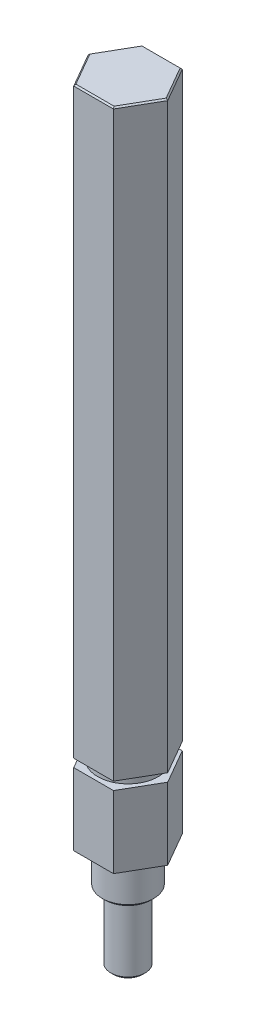
ISO-10303-21;
HEADER;
FILE_DESCRIPTION(('STEP AP214'),'2;1');
FILE_NAME('part.step','',(''),(''),'','','');
FILE_SCHEMA(('AUTOMOTIVE_DESIGN { 1 0 10303 214 1 1 1 1 }'));
ENDSEC;
DATA;
#1=APPLICATION_CONTEXT('core data for automotive mechanical design processes');
#2=APPLICATION_PROTOCOL_DEFINITION('international standard','automotive_design',2000,#1);
#3=PRODUCT_CONTEXT('',#1,'mechanical');
#4=PRODUCT('Part','Part','',(#3));
#5=PRODUCT_RELATED_PRODUCT_CATEGORY('part','',(#4));
#6=PRODUCT_DEFINITION_FORMATION('','',#4);
#7=PRODUCT_DEFINITION_CONTEXT('part definition',#1,'design');
#8=PRODUCT_DEFINITION('design','',#6,#7);
#9=PRODUCT_DEFINITION_SHAPE('','',#8);
#10=(LENGTH_UNIT() NAMED_UNIT(*) SI_UNIT(.MILLI.,.METRE.));
#11=(NAMED_UNIT(*) PLANE_ANGLE_UNIT() SI_UNIT($,.RADIAN.));
#12=(NAMED_UNIT(*) SI_UNIT($,.STERADIAN.) SOLID_ANGLE_UNIT());
#13=UNCERTAINTY_MEASURE_WITH_UNIT(LENGTH_MEASURE(1.E-05),#10,'distance_accuracy_value','');
#14=(GEOMETRIC_REPRESENTATION_CONTEXT(3) GLOBAL_UNCERTAINTY_ASSIGNED_CONTEXT((#13)) GLOBAL_UNIT_ASSIGNED_CONTEXT((#10,
#11,#12)) REPRESENTATION_CONTEXT('',''));
#15=CARTESIAN_POINT('',(0.,0.,0.));
#16=DIRECTION('',(0.,0.,1.));
#17=DIRECTION('',(1.,0.,0.));
#18=AXIS2_PLACEMENT_3D('',#15,#16,#17);
#19=CARTESIAN_POINT('',(-38.3071337161431,-45.212,-16.669011646302));
#20=DIRECTION('',(0.,1.,0.));
#21=DIRECTION('',(0.,0.,1.));
#22=AXIS2_PLACEMENT_3D('',#19,#20,#21);
#23=PLANE('',#22);
#24=CARTESIAN_POINT('',(-38.3071337161431,-45.2119999999923,-16.669011646302));
#25=DIRECTION('',(0.,1.,0.));
#26=DIRECTION('',(0.,0.,1.));
#27=AXIS2_PLACEMENT_3D('',#24,#25,#26);
#28=CIRCLE('',#27,2.65430000009029);
#29=CARTESIAN_POINT('',(-38.3071337161431,-45.2119999999923,-14.0147116462117));
#30=VERTEX_POINT('',#29);
#31=EDGE_CURVE('E19',#30,#30,#28,.T.);
#32=ORIENTED_EDGE('',*,*,#31,.F.);
#33=EDGE_LOOP('',(#32));
#34=FACE_BOUND('',#33,.T.);
#35=ADVANCED_FACE('F16',(#34),#23,.F.);
#36=CARTESIAN_POINT('',(-38.3071337161431,-44.704000000138,-16.669011646302));
#37=DIRECTION('',(0.,1.,0.));
#38=DIRECTION('',(0.,0.,1.));
#39=AXIS2_PLACEMENT_3D('',#36,#37,#38);
#40=CONICAL_SURFACE('',#39,3.16229999994458,0.785398163397448);
#41=CARTESIAN_POINT('',(-38.3071337161431,-44.704,-16.669011646302));
#42=DIRECTION('',(0.,1.,0.));
#43=DIRECTION('',(0.,0.,1.));
#44=AXIS2_PLACEMENT_3D('',#41,#42,#43);
#45=CIRCLE('',#44,3.1623);
#46=CARTESIAN_POINT('',(-38.3071337161431,-44.704,-13.506711646302));
#47=VERTEX_POINT('',#46);
#48=EDGE_CURVE('E179',#47,#47,#45,.T.);
#49=ORIENTED_EDGE('',*,*,#48,.F.);
#50=EDGE_LOOP('',(#49));
#51=FACE_BOUND('',#50,.T.);
#52=ORIENTED_EDGE('',*,*,#31,.T.);
#53=EDGE_LOOP('',(#52));
#54=FACE_BOUND('',#53,.T.);
#55=ADVANCED_FACE('F221',(#51,#54),#40,.T.);
#56=CARTESIAN_POINT('',(-38.3071337161431,-45.212,-16.669011646302));
#57=DIRECTION('',(0.,1.,0.));
#58=DIRECTION('',(0.,0.,1.));
#59=AXIS2_PLACEMENT_3D('',#56,#57,#58);
#60=CYLINDRICAL_SURFACE('',#59,3.1623);
#61=CARTESIAN_POINT('',(-38.3071337161431,-32.512,-16.669011646302));
#62=DIRECTION('',(0.,1.,0.));
#63=DIRECTION('',(0.,0.,1.));
#64=AXIS2_PLACEMENT_3D('',#61,#62,#63);
#65=CIRCLE('',#64,3.1623);
#66=CARTESIAN_POINT('',(-38.3071337161431,-32.512,-13.506711646302));
#67=VERTEX_POINT('',#66);
#68=EDGE_CURVE('E183',#67,#67,#65,.F.);
#69=ORIENTED_EDGE('',*,*,#68,.T.);
#70=EDGE_LOOP('',(#69));
#71=FACE_BOUND('',#70,.T.);
#72=ORIENTED_EDGE('',*,*,#48,.T.);
#73=EDGE_LOOP('',(#72));
#74=FACE_BOUND('',#73,.T.);
#75=ADVANCED_FACE('F205',(#71,#74),#60,.T.);
#76=CARTESIAN_POINT('',(-38.3071337161431,-32.512,-16.669011646302));
#77=DIRECTION('',(0.,1.,0.));
#78=DIRECTION('',(0.,0.,1.));
#79=AXIS2_PLACEMENT_3D('',#76,#77,#78);
#80=PLANE('',#79);
#81=CARTESIAN_POINT('',(-38.3071337161431,-32.511999999997,-16.669011646302));
#82=DIRECTION('',(0.,1.,0.));
#83=DIRECTION('',(0.,0.,1.));
#84=AXIS2_PLACEMENT_3D('',#81,#82,#83);
#85=CIRCLE('',#84,4.24179999994759);
#86=CARTESIAN_POINT('',(-38.3071337161431,-32.511999999997,-12.4272116463544));
#87=VERTEX_POINT('',#86);
#88=EDGE_CURVE('E178',#87,#87,#85,.T.);
#89=ORIENTED_EDGE('',*,*,#88,.F.);
#90=EDGE_LOOP('',(#89));
#91=FACE_BOUND('',#90,.T.);
#92=ORIENTED_EDGE('',*,*,#68,.F.);
#93=EDGE_LOOP('',(#92));
#94=FACE_BOUND('',#93,.T.);
#95=ADVANCED_FACE('F208',(#91,#94),#80,.F.);
#96=CARTESIAN_POINT('',(-38.3071337161431,-32.0039999999722,-16.669011646302));
#97=DIRECTION('',(0.,1.,0.));
#98=DIRECTION('',(0.,0.,1.));
#99=AXIS2_PLACEMENT_3D('',#96,#97,#98);
#100=CONICAL_SURFACE('',#99,4.74979999991557,0.7853981633415);
#101=CARTESIAN_POINT('',(-38.3071337161431,-32.004,-16.669011646302));
#102=DIRECTION('',(0.,1.,0.));
#103=DIRECTION('',(0.,0.,1.));
#104=AXIS2_PLACEMENT_3D('',#101,#102,#103);
#105=CIRCLE('',#104,4.7498);
#106=CARTESIAN_POINT('',(-38.3071337161431,-32.004,-11.919211646302));
#107=VERTEX_POINT('',#106);
#108=EDGE_CURVE('E174',#107,#107,#105,.T.);
#109=ORIENTED_EDGE('',*,*,#108,.F.);
#110=EDGE_LOOP('',(#109));
#111=FACE_BOUND('',#110,.T.);
#112=ORIENTED_EDGE('',*,*,#88,.T.);
#113=EDGE_LOOP('',(#112));
#114=FACE_BOUND('',#113,.T.);
#115=ADVANCED_FACE('F210',(#111,#114),#100,.T.);
#116=CARTESIAN_POINT('',(-38.3071337161431,-32.512,-16.669011646302));
#117=DIRECTION('',(0.,1.,0.));
#118=DIRECTION('',(0.,0.,1.));
#119=AXIS2_PLACEMENT_3D('',#116,#117,#118);
#120=CYLINDRICAL_SURFACE('',#119,4.7498);
#121=CARTESIAN_POINT('',(-38.3071337161431,-25.4,-16.669011646302));
#122=DIRECTION('',(0.,1.,0.));
#123=DIRECTION('',(0.,0.,1.));
#124=AXIS2_PLACEMENT_3D('',#121,#122,#123);
#125=CIRCLE('',#124,4.7498);
#126=CARTESIAN_POINT('',(-38.3071337161431,-25.4,-11.919211646302));
#127=VERTEX_POINT('',#126);
#128=EDGE_CURVE('E152',#127,#127,#125,.F.);
#129=ORIENTED_EDGE('',*,*,#128,.T.);
#130=EDGE_LOOP('',(#129));
#131=FACE_BOUND('',#130,.T.);
#132=ORIENTED_EDGE('',*,*,#108,.T.);
#133=EDGE_LOOP('',(#132));
#134=FACE_BOUND('',#133,.T.);
#135=ADVANCED_FACE('F217',(#131,#134),#120,.T.);
#136=CARTESIAN_POINT('',(-38.3071337161431,-25.4,-3.96901164630201));
#137=DIRECTION('',(0.,1.,0.));
#138=DIRECTION('',(0.,0.,1.));
#139=AXIS2_PLACEMENT_3D('',#136,#137,#138);
#140=PLANE('',#139);
#141=DIRECTION('',(-0.5,0.,0.866025403784439));
#142=VECTOR('',#141,1.);
#143=CARTESIAN_POINT('',(-41.9733079254973,-25.4,-23.019011646302));
#144=LINE('',#143,#142);
#145=CARTESIAN_POINT('',(-41.9733079254973,-25.4,-23.019011646302));
#146=VERTEX_POINT('',#145);
#147=CARTESIAN_POINT('',(-45.6394821348514,-25.4,-16.669011646302));
#148=VERTEX_POINT('',#147);
#149=EDGE_CURVE('E143',#146,#148,#144,.T.);
#150=ORIENTED_EDGE('',*,*,#149,.F.);
#151=DIRECTION('',(-1.,0.,0.));
#152=VECTOR('',#151,1.);
#153=CARTESIAN_POINT('',(-34.640959506789,-25.4,-23.019011646302));
#154=LINE('',#153,#152);
#155=CARTESIAN_POINT('',(-34.640959506789,-25.4,-23.019011646302));
#156=VERTEX_POINT('',#155);
#157=EDGE_CURVE('E139',#156,#146,#154,.T.);
#158=ORIENTED_EDGE('',*,*,#157,.F.);
#159=DIRECTION('',(-0.5,0.,-0.866025403784439));
#160=VECTOR('',#159,1.);
#161=CARTESIAN_POINT('',(-30.9747852974349,-25.4,-16.669011646302));
#162=LINE('',#161,#160);
#163=CARTESIAN_POINT('',(-30.9747852974349,-25.4,-16.669011646302));
#164=VERTEX_POINT('',#163);
#165=EDGE_CURVE('E162',#164,#156,#162,.T.);
#166=ORIENTED_EDGE('',*,*,#165,.F.);
#167=DIRECTION('',(0.500000000000001,0.,-0.866025403784438));
#168=VECTOR('',#167,1.);
#169=CARTESIAN_POINT('',(-34.640959506789,-25.4,-10.319011646302));
#170=LINE('',#169,#168);
#171=CARTESIAN_POINT('',(-34.640959506789,-25.4,-10.319011646302));
#172=VERTEX_POINT('',#171);
#173=EDGE_CURVE('E526',#172,#164,#170,.T.);
#174=ORIENTED_EDGE('',*,*,#173,.F.);
#175=DIRECTION('',(1.,0.,0.));
#176=VECTOR('',#175,1.);
#177=CARTESIAN_POINT('',(-41.9733079254973,-25.4,-10.319011646302));
#178=LINE('',#177,#176);
#179=CARTESIAN_POINT('',(-41.9733079254973,-25.4,-10.319011646302));
#180=VERTEX_POINT('',#179);
#181=EDGE_CURVE('E532',#180,#172,#178,.T.);
#182=ORIENTED_EDGE('',*,*,#181,.F.);
#183=DIRECTION('',(0.5,0.,0.866025403784439));
#184=VECTOR('',#183,1.);
#185=CARTESIAN_POINT('',(-45.6394821348514,-25.4,-16.669011646302));
#186=LINE('',#185,#184);
#187=EDGE_CURVE('E148',#148,#180,#186,.T.);
#188=ORIENTED_EDGE('',*,*,#187,.F.);
#189=EDGE_LOOP('',(#150,#158,#166,#174,#182,#188));
#190=FACE_BOUND('',#189,.T.);
#191=ORIENTED_EDGE('',*,*,#128,.F.);
#192=EDGE_LOOP('',(#191));
#193=FACE_BOUND('',#192,.T.);
#194=ADVANCED_FACE('F145',(#190,#193),#140,.F.);
#195=CARTESIAN_POINT('',(-41.9733079254973,-25.4,-23.019011646302));
#196=DIRECTION('',(-0.866025403784439,0.,-0.5));
#197=DIRECTION('',(-0.5,0.,0.866025403784439));
#198=AXIS2_PLACEMENT_3D('',#195,#196,#197);
#199=PLANE('',#198);
#200=ORIENTED_EDGE('',*,*,#149,.T.);
#201=DIRECTION('',(0.,1.,0.));
#202=VECTOR('',#201,1.);
#203=CARTESIAN_POINT('',(-45.6394821348514,-25.4,-16.669011646302));
#204=LINE('',#203,#202);
#205=CARTESIAN_POINT('',(-45.6394821348514,-12.1158,-16.669011646302));
#206=VERTEX_POINT('',#205);
#207=EDGE_CURVE('E540',#206,#148,#204,.F.);
#208=ORIENTED_EDGE('',*,*,#207,.F.);
#209=DIRECTION('',(0.5,0.,-0.866025403784439));
#210=VECTOR('',#209,1.);
#211=CARTESIAN_POINT('',(-45.6394821348514,-12.1158,-16.669011646302));
#212=LINE('',#211,#210);
#213=CARTESIAN_POINT('',(-41.9733079254973,-12.1158,-23.019011646302));
#214=VERTEX_POINT('',#213);
#215=EDGE_CURVE('E158',#206,#214,#212,.T.);
#216=ORIENTED_EDGE('',*,*,#215,.T.);
#217=DIRECTION('',(0.,1.,0.));
#218=VECTOR('',#217,1.);
#219=CARTESIAN_POINT('',(-41.9733079254973,-25.4,-23.019011646302));
#220=LINE('',#219,#218);
#221=EDGE_CURVE('E155',#146,#214,#220,.T.);
#222=ORIENTED_EDGE('',*,*,#221,.F.);
#223=EDGE_LOOP('',(#200,#208,#216,#222));
#224=FACE_BOUND('',#223,.T.);
#225=ADVANCED_FACE('F156',(#224),#199,.T.);
#226=CARTESIAN_POINT('',(-34.640959506789,-25.4,-23.019011646302));
#227=DIRECTION('',(0.,0.,-1.));
#228=DIRECTION('',(-1.,0.,0.));
#229=AXIS2_PLACEMENT_3D('',#226,#227,#228);
#230=PLANE('',#229);
#231=ORIENTED_EDGE('',*,*,#157,.T.);
#232=ORIENTED_EDGE('',*,*,#221,.T.);
#233=DIRECTION('',(1.,0.,0.));
#234=VECTOR('',#233,1.);
#235=CARTESIAN_POINT('',(-21.7881364409388,-12.1158,-23.019011646302));
#236=LINE('',#235,#234);
#237=CARTESIAN_POINT('',(-34.640959506789,-12.1158,-23.019011646302));
#238=VERTEX_POINT('',#237);
#239=EDGE_CURVE('E553',#214,#238,#236,.T.);
#240=ORIENTED_EDGE('',*,*,#239,.T.);
#241=DIRECTION('',(0.,1.,0.));
#242=VECTOR('',#241,1.);
#243=CARTESIAN_POINT('',(-34.640959506789,-25.4,-23.019011646302));
#244=LINE('',#243,#242);
#245=EDGE_CURVE('E166',#156,#238,#244,.T.);
#246=ORIENTED_EDGE('',*,*,#245,.F.);
#247=EDGE_LOOP('',(#231,#232,#240,#246));
#248=FACE_BOUND('',#247,.T.);
#249=ADVANCED_FACE('F164',(#248),#230,.T.);
#250=CARTESIAN_POINT('',(-30.9747852974349,-25.4,-16.669011646302));
#251=DIRECTION('',(0.866025403784439,0.,-0.5));
#252=DIRECTION('',(-0.5,0.,-0.866025403784439));
#253=AXIS2_PLACEMENT_3D('',#250,#251,#252);
#254=PLANE('',#253);
#255=ORIENTED_EDGE('',*,*,#165,.T.);
#256=ORIENTED_EDGE('',*,*,#245,.T.);
#257=DIRECTION('',(0.5,0.,0.866025403784438));
#258=VECTOR('',#257,1.);
#259=CARTESIAN_POINT('',(-34.640959506789,-12.1158,-23.019011646302));
#260=LINE('',#259,#258);
#261=CARTESIAN_POINT('',(-30.9747852974349,-12.1158,-16.669011646302));
#262=VERTEX_POINT('',#261);
#263=EDGE_CURVE('E556',#238,#262,#260,.T.);
#264=ORIENTED_EDGE('',*,*,#263,.T.);
#265=DIRECTION('',(0.,1.,0.));
#266=VECTOR('',#265,1.);
#267=CARTESIAN_POINT('',(-30.9747852974349,-25.4,-16.669011646302));
#268=LINE('',#267,#266);
#269=EDGE_CURVE('E520',#164,#262,#268,.T.);
#270=ORIENTED_EDGE('',*,*,#269,.F.);
#271=EDGE_LOOP('',(#255,#256,#264,#270));
#272=FACE_BOUND('',#271,.T.);
#273=ADVANCED_FACE('F302',(#272),#254,.T.);
#274=CARTESIAN_POINT('',(-34.640959506789,-25.4,-10.319011646302));
#275=DIRECTION('',(0.866025403784438,0.,0.500000000000001));
#276=DIRECTION('',(0.500000000000001,0.,-0.866025403784438));
#277=AXIS2_PLACEMENT_3D('',#274,#275,#276);
#278=PLANE('',#277);
#279=ORIENTED_EDGE('',*,*,#173,.T.);
#280=ORIENTED_EDGE('',*,*,#269,.T.);
#281=DIRECTION('',(-0.500000000000001,0.,0.866025403784438));
#282=VECTOR('',#281,1.);
#283=CARTESIAN_POINT('',(-30.9747852974349,-12.1158,-16.669011646302));
#284=LINE('',#283,#282);
#285=CARTESIAN_POINT('',(-34.640959506789,-12.1158,-10.319011646302));
#286=VERTEX_POINT('',#285);
#287=EDGE_CURVE('E559',#262,#286,#284,.T.);
#288=ORIENTED_EDGE('',*,*,#287,.T.);
#289=DIRECTION('',(0.,1.,0.));
#290=VECTOR('',#289,1.);
#291=CARTESIAN_POINT('',(-34.640959506789,-25.4,-10.319011646302));
#292=LINE('',#291,#290);
#293=EDGE_CURVE('E536',#172,#286,#292,.T.);
#294=ORIENTED_EDGE('',*,*,#293,.F.);
#295=EDGE_LOOP('',(#279,#280,#288,#294));
#296=FACE_BOUND('',#295,.T.);
#297=ADVANCED_FACE('F299',(#296),#278,.T.);
#298=CARTESIAN_POINT('',(-41.9733079254973,-25.4,-10.319011646302));
#299=DIRECTION('',(0.,0.,1.));
#300=DIRECTION('',(1.,0.,0.));
#301=AXIS2_PLACEMENT_3D('',#298,#299,#300);
#302=PLANE('',#301);
#303=ORIENTED_EDGE('',*,*,#181,.T.);
#304=ORIENTED_EDGE('',*,*,#293,.T.);
#305=DIRECTION('',(1.,0.,0.));
#306=VECTOR('',#305,1.);
#307=CARTESIAN_POINT('',(-21.7881364409388,-12.1158,-10.319011646302));
#308=LINE('',#307,#306);
#309=CARTESIAN_POINT('',(-41.9733079254973,-12.1158,-10.319011646302));
#310=VERTEX_POINT('',#309);
#311=EDGE_CURVE('E562',#286,#310,#308,.F.);
#312=ORIENTED_EDGE('',*,*,#311,.T.);
#313=DIRECTION('',(0.,1.,0.));
#314=VECTOR('',#313,1.);
#315=CARTESIAN_POINT('',(-41.9733079254973,-25.4,-10.319011646302));
#316=LINE('',#315,#314);
#317=EDGE_CURVE('E544',#180,#310,#316,.T.);
#318=ORIENTED_EDGE('',*,*,#317,.F.);
#319=EDGE_LOOP('',(#303,#304,#312,#318));
#320=FACE_BOUND('',#319,.T.);
#321=ADVANCED_FACE('F295',(#320),#302,.T.);
#322=CARTESIAN_POINT('',(-45.6394821348514,-25.4,-16.669011646302));
#323=DIRECTION('',(-0.866025403784439,0.,0.5));
#324=DIRECTION('',(0.5,0.,0.866025403784439));
#325=AXIS2_PLACEMENT_3D('',#322,#323,#324);
#326=PLANE('',#325);
#327=ORIENTED_EDGE('',*,*,#187,.T.);
#328=ORIENTED_EDGE('',*,*,#317,.T.);
#329=DIRECTION('',(-0.5,0.,-0.866025403784438));
#330=VECTOR('',#329,1.);
#331=CARTESIAN_POINT('',(-41.9733079254973,-12.1158,-10.319011646302));
#332=LINE('',#331,#330);
#333=EDGE_CURVE('E565',#310,#206,#332,.T.);
#334=ORIENTED_EDGE('',*,*,#333,.T.);
#335=ORIENTED_EDGE('',*,*,#207,.T.);
#336=EDGE_LOOP('',(#327,#328,#334,#335));
#337=FACE_BOUND('',#336,.T.);
#338=ADVANCED_FACE('F291',(#337),#326,.T.);
#339=CARTESIAN_POINT('',(-38.3071337161451,97.0813400000005,-10.573011646302));
#340=DIRECTION('',(0.,-0.707106781186544,-0.707106781186551));
#341=DIRECTION('',(0.,0.707106781186551,-0.707106781186544));
#342=AXIS2_PLACEMENT_3D('',#339,#340,#341);
#343=PLANE('',#342);
#344=DIRECTION('',(1.,0.,0.));
#345=VECTOR('',#344,1.);
#346=CARTESIAN_POINT('',(-41.9733079254973,96.8273400000005,-10.319011646302));
#347=LINE('',#346,#345);
#348=CARTESIAN_POINT('',(-34.640959506789,96.8273400000005,-10.319011646302));
#349=VERTEX_POINT('',#348);
#350=CARTESIAN_POINT('',(-41.9733079254973,96.8273400000005,-10.319011646302));
#351=VERTEX_POINT('',#350);
#352=EDGE_CURVE('E589',#349,#351,#347,.F.);
#353=ORIENTED_EDGE('',*,*,#352,.F.);
#354=DIRECTION('',(-0.377964473009223,0.654653670707976,-0.654653670707981));
#355=VECTOR('',#354,1.);
#356=CARTESIAN_POINT('',(-34.640959506789,96.8273400000005,-10.319011646302));
#357=LINE('',#356,#355);
#358=CARTESIAN_POINT('',(-34.7876064751632,97.0813400000005,-10.573011646302));
#359=VERTEX_POINT('',#358);
#360=EDGE_CURVE('E548',#349,#359,#357,.T.);
#361=ORIENTED_EDGE('',*,*,#360,.T.);
#362=DIRECTION('',(1.,0.,0.));
#363=VECTOR('',#362,1.);
#364=CARTESIAN_POINT('',(-38.3071337161451,97.0813400000005,-10.573011646302));
#365=LINE('',#364,#363);
#366=CARTESIAN_POINT('',(-41.8266609571231,97.0813400000005,-10.573011646302));
#367=VERTEX_POINT('',#366);
#368=EDGE_CURVE('E576',#367,#359,#365,.T.);
#369=ORIENTED_EDGE('',*,*,#368,.F.);
#370=DIRECTION('',(-0.377964473009255,-0.654653670707976,0.654653670707962));
#371=VECTOR('',#370,1.);
#372=CARTESIAN_POINT('',(-41.8266609571231,97.0813400000005,-10.573011646302));
#373=LINE('',#372,#371);
#374=EDGE_CURVE('E569',#367,#351,#373,.T.);
#375=ORIENTED_EDGE('',*,*,#374,.T.);
#376=EDGE_LOOP('',(#353,#361,#369,#375));
#377=FACE_BOUND('',#376,.T.);
#378=ADVANCED_FACE('F287',(#377),#343,.F.);
#379=CARTESIAN_POINT('',(-33.0278428546734,97.0813400000005,-13.6210116463016));
#380=DIRECTION('',(-0.612372435695796,-0.707106781186546,-0.353553390593275));
#381=DIRECTION('',(0.755928946018453,-0.654653670707979,0.));
#382=AXIS2_PLACEMENT_3D('',#379,#380,#381);
#383=PLANE('',#382);
#384=DIRECTION('',(0.500000000000001,0.,-0.866025403784438));
#385=VECTOR('',#384,1.);
#386=CARTESIAN_POINT('',(-34.7876064751632,97.0813400000005,-10.573011646302));
#387=LINE('',#386,#385);
#388=CARTESIAN_POINT('',(-31.2680792341832,97.0813400000005,-16.669011646302));
#389=VERTEX_POINT('',#388);
#390=EDGE_CURVE('E579',#359,#389,#387,.T.);
#391=ORIENTED_EDGE('',*,*,#390,.F.);
#392=ORIENTED_EDGE('',*,*,#360,.F.);
#393=DIRECTION('',(0.500000000000001,0.,-0.866025403784438));
#394=VECTOR('',#393,1.);
#395=CARTESIAN_POINT('',(-34.640959506789,96.8273400000004,-10.319011646302));
#396=LINE('',#395,#394);
#397=CARTESIAN_POINT('',(-30.9747852974349,96.8273400000005,-16.669011646302));
#398=VERTEX_POINT('',#397);
#399=EDGE_CURVE('E592',#398,#349,#396,.F.);
#400=ORIENTED_EDGE('',*,*,#399,.F.);
#401=DIRECTION('',(0.755928946018445,-0.654653670707988,0.));
#402=VECTOR('',#401,1.);
#403=CARTESIAN_POINT('',(-32.2736584458922,97.952197142858,-16.669011646302));
#404=LINE('',#403,#402);
#405=EDGE_CURVE('E550',#398,#389,#404,.F.);
#406=ORIENTED_EDGE('',*,*,#405,.T.);
#407=EDGE_LOOP('',(#391,#392,#400,#406));
#408=FACE_BOUND('',#407,.T.);
#409=ADVANCED_FACE('F283',(#408),#383,.F.);
#410=CARTESIAN_POINT('',(-33.0278428546739,97.0813400000005,-19.7170116463033));
#411=DIRECTION('',(-0.612372435695803,-0.707106781186538,0.353553390593279));
#412=DIRECTION('',(0.755928946018445,-0.654653670707988,0.));
#413=AXIS2_PLACEMENT_3D('',#410,#411,#412);
#414=PLANE('',#413);
#415=DIRECTION('',(-0.5,0.,-0.866025403784439));
#416=VECTOR('',#415,1.);
#417=CARTESIAN_POINT('',(-31.2680792341832,97.0813400000005,-16.669011646302));
#418=LINE('',#417,#416);
#419=CARTESIAN_POINT('',(-34.7876064751632,97.0813400000005,-22.765011646302));
#420=VERTEX_POINT('',#419);
#421=EDGE_CURVE('E582',#389,#420,#418,.T.);
#422=ORIENTED_EDGE('',*,*,#421,.F.);
#423=ORIENTED_EDGE('',*,*,#405,.F.);
#424=DIRECTION('',(-0.5,0.,-0.866025403784439));
#425=VECTOR('',#424,1.);
#426=CARTESIAN_POINT('',(-30.9747852974349,96.8273400000005,-16.669011646302));
#427=LINE('',#426,#425);
#428=CARTESIAN_POINT('',(-34.640959506789,96.8273400000005,-23.019011646302));
#429=VERTEX_POINT('',#428);
#430=EDGE_CURVE('E599',#429,#398,#427,.F.);
#431=ORIENTED_EDGE('',*,*,#430,.F.);
#432=DIRECTION('',(-0.377964473009211,0.654653670707982,0.654653670707982));
#433=VECTOR('',#432,1.);
#434=CARTESIAN_POINT('',(-34.640959506789,96.8273400000005,-23.019011646302));
#435=LINE('',#434,#433);
#436=EDGE_CURVE('E586',#429,#420,#435,.T.);
#437=ORIENTED_EDGE('',*,*,#436,.T.);
#438=EDGE_LOOP('',(#422,#423,#431,#437));
#439=FACE_BOUND('',#438,.T.);
#440=ADVANCED_FACE('F279',(#439),#414,.F.);
#441=CARTESIAN_POINT('',(-21.7881364409388,-12.1158,-16.669011646302));
#442=DIRECTION('',(0.,-1.,0.));
#443=DIRECTION('',(0.,0.,-1.));
#444=AXIS2_PLACEMENT_3D('',#441,#442,#443);
#445=PLANE('',#444);
#446=ORIENTED_EDGE('',*,*,#311,.F.);
#447=ORIENTED_EDGE('',*,*,#287,.F.);
#448=ORIENTED_EDGE('',*,*,#263,.F.);
#449=ORIENTED_EDGE('',*,*,#239,.F.);
#450=ORIENTED_EDGE('',*,*,#215,.F.);
#451=ORIENTED_EDGE('',*,*,#333,.F.);
#452=EDGE_LOOP('',(#446,#447,#448,#449,#450,#451));
#453=FACE_BOUND('',#452,.T.);
#454=CARTESIAN_POINT('',(-38.3071337161431,-12.1158,-16.669011646302));
#455=DIRECTION('',(0.,1.,0.));
#456=DIRECTION('',(0.,0.,1.));
#457=AXIS2_PLACEMENT_3D('',#454,#455,#456);
#458=CIRCLE('',#457,5.58800000000003);
#459=CARTESIAN_POINT('',(-38.3071337161431,-12.1158,-11.081011646302));
#460=VERTEX_POINT('',#459);
#461=EDGE_CURVE('E190',#460,#460,#458,.T.);
#462=ORIENTED_EDGE('',*,*,#461,.F.);
#463=EDGE_LOOP('',(#462));
#464=FACE_BOUND('',#463,.T.);
#465=ADVANCED_FACE('F275',(#453,#464),#445,.F.);
#466=CARTESIAN_POINT('',(-43.5864245776138,97.0813400000005,-13.6210116463033));
#467=DIRECTION('',(0.612372435695786,-0.707106781186557,-0.353553390593269));
#468=DIRECTION('',(0.755928946018463,0.654653670707967,0.));
#469=AXIS2_PLACEMENT_3D('',#466,#467,#468);
#470=PLANE('',#469);
#471=DIRECTION('',(0.5,0.,0.866025403784439));
#472=VECTOR('',#471,1.);
#473=CARTESIAN_POINT('',(-45.6394821348514,96.8273400000005,-16.669011646302));
#474=LINE('',#473,#472);
#475=CARTESIAN_POINT('',(-45.6394821348514,96.8273400000005,-16.669011646302));
#476=VERTEX_POINT('',#475);
#477=EDGE_CURVE('E608',#351,#476,#474,.F.);
#478=ORIENTED_EDGE('',*,*,#477,.F.);
#479=ORIENTED_EDGE('',*,*,#374,.F.);
#480=DIRECTION('',(0.5,0.,0.866025403784439));
#481=VECTOR('',#480,1.);
#482=CARTESIAN_POINT('',(-45.3461881981031,97.0813400000005,-16.669011646302));
#483=LINE('',#482,#481);
#484=CARTESIAN_POINT('',(-45.346188198103,97.0813400000005,-16.669011646302));
#485=VERTEX_POINT('',#484);
#486=EDGE_CURVE('E573',#485,#367,#483,.T.);
#487=ORIENTED_EDGE('',*,*,#486,.F.);
#488=DIRECTION('',(0.755928946018463,0.654653670707967,0.));
#489=VECTOR('',#488,1.);
#490=CARTESIAN_POINT('',(-44.3406089863949,97.9521971428572,-16.669011646302));
#491=LINE('',#490,#489);
#492=EDGE_CURVE('E571',#476,#485,#491,.T.);
#493=ORIENTED_EDGE('',*,*,#492,.F.);
#494=EDGE_LOOP('',(#478,#479,#487,#493));
#495=FACE_BOUND('',#494,.T.);
#496=ADVANCED_FACE('F271',(#495),#470,.F.);
#497=CARTESIAN_POINT('',(-38.3071337161451,97.0813400000005,-16.6690116463026));
#498=DIRECTION('',(0.,1.,0.));
#499=DIRECTION('',(0.,0.,1.));
#500=AXIS2_PLACEMENT_3D('',#497,#498,#499);
#501=PLANE('',#500);
#502=DIRECTION('',(1.,0.,0.));
#503=VECTOR('',#502,1.);
#504=CARTESIAN_POINT('',(-38.3071337161451,97.0813400000005,-22.765011646302));
#505=LINE('',#504,#503);
#506=CARTESIAN_POINT('',(-41.8266609571231,97.0813400000005,-22.765011646302));
#507=VERTEX_POINT('',#506);
#508=EDGE_CURVE('E584',#420,#507,#505,.F.);
#509=ORIENTED_EDGE('',*,*,#508,.T.);
#510=DIRECTION('',(-0.500000000000001,0.,0.866025403784438));
#511=VECTOR('',#510,1.);
#512=CARTESIAN_POINT('',(-41.8266609571231,97.0813400000005,-22.765011646302));
#513=LINE('',#512,#511);
#514=EDGE_CURVE('E611',#507,#485,#513,.T.);
#515=ORIENTED_EDGE('',*,*,#514,.T.);
#516=ORIENTED_EDGE('',*,*,#486,.T.);
#517=ORIENTED_EDGE('',*,*,#368,.T.);
#518=ORIENTED_EDGE('',*,*,#390,.T.);
#519=ORIENTED_EDGE('',*,*,#421,.T.);
#520=EDGE_LOOP('',(#509,#515,#516,#517,#518,#519));
#521=FACE_BOUND('',#520,.T.);
#522=ADVANCED_FACE('F267',(#521),#501,.T.);
#523=CARTESIAN_POINT('',(-38.3071337161451,97.0813400000005,-22.765011646302));
#524=DIRECTION('',(0.,-0.707106781186551,0.707106781186544));
#525=DIRECTION('',(0.,-0.707106781186544,-0.707106781186551));
#526=AXIS2_PLACEMENT_3D('',#523,#524,#525);
#527=PLANE('',#526);
#528=DIRECTION('',(-1.,0.,0.));
#529=VECTOR('',#528,1.);
#530=CARTESIAN_POINT('',(-34.640959506789,96.8273400000005,-23.019011646302));
#531=LINE('',#530,#529);
#532=CARTESIAN_POINT('',(-41.9733079254973,96.8273400000005,-23.019011646302));
#533=VERTEX_POINT('',#532);
#534=EDGE_CURVE('E617',#533,#429,#531,.F.);
#535=ORIENTED_EDGE('',*,*,#534,.F.);
#536=DIRECTION('',(0.377964473009259,0.654653670707977,0.654653670707959));
#537=VECTOR('',#536,1.);
#538=CARTESIAN_POINT('',(-41.9733079254973,96.8273400000005,-23.019011646302));
#539=LINE('',#538,#537);
#540=EDGE_CURVE('E614',#533,#507,#539,.T.);
#541=ORIENTED_EDGE('',*,*,#540,.T.);
#542=ORIENTED_EDGE('',*,*,#508,.F.);
#543=ORIENTED_EDGE('',*,*,#436,.F.);
#544=EDGE_LOOP('',(#535,#541,#542,#543));
#545=FACE_BOUND('',#544,.T.);
#546=ADVANCED_FACE('F263',(#545),#527,.F.);
#547=CARTESIAN_POINT('',(-41.9733079254973,-25.4,-10.319011646302));
#548=DIRECTION('',(0.,0.,1.));
#549=DIRECTION('',(1.,0.,0.));
#550=AXIS2_PLACEMENT_3D('',#547,#548,#549);
#551=PLANE('',#550);
#552=DIRECTION('',(0.,1.,0.));
#553=VECTOR('',#552,1.);
#554=CARTESIAN_POINT('',(-41.9733079254973,-25.4,-10.319011646302));
#555=LINE('',#554,#553);
#556=CARTESIAN_POINT('',(-41.9733079254973,-10.6172,-10.319011646302));
#557=VERTEX_POINT('',#556);
#558=EDGE_CURVE('E194',#557,#351,#555,.T.);
#559=ORIENTED_EDGE('',*,*,#558,.F.);
#560=DIRECTION('',(1.,0.,0.));
#561=VECTOR('',#560,1.);
#562=CARTESIAN_POINT('',(-32.7191337161431,-10.6172,-10.319011646302));
#563=LINE('',#562,#561);
#564=CARTESIAN_POINT('',(-34.640959506789,-10.6172,-10.319011646302));
#565=VERTEX_POINT('',#564);
#566=EDGE_CURVE('E629',#557,#565,#563,.T.);
#567=ORIENTED_EDGE('',*,*,#566,.T.);
#568=DIRECTION('',(0.,1.,0.));
#569=VECTOR('',#568,1.);
#570=CARTESIAN_POINT('',(-34.640959506789,-25.4,-10.319011646302));
#571=LINE('',#570,#569);
#572=EDGE_CURVE('E595',#349,#565,#571,.F.);
#573=ORIENTED_EDGE('',*,*,#572,.F.);
#574=ORIENTED_EDGE('',*,*,#352,.T.);
#575=EDGE_LOOP('',(#559,#567,#573,#574));
#576=FACE_BOUND('',#575,.T.);
#577=ADVANCED_FACE('F259',(#576),#551,.T.);
#578=CARTESIAN_POINT('',(-34.640959506789,-25.4,-10.319011646302));
#579=DIRECTION('',(0.866025403784438,0.,0.500000000000001));
#580=DIRECTION('',(0.500000000000001,0.,-0.866025403784438));
#581=AXIS2_PLACEMENT_3D('',#578,#579,#580);
#582=PLANE('',#581);
#583=ORIENTED_EDGE('',*,*,#572,.T.);
#584=DIRECTION('',(0.500000000000001,0.,-0.866025403784438));
#585=VECTOR('',#584,1.);
#586=CARTESIAN_POINT('',(-34.640959506789,-10.6172,-10.319011646302));
#587=LINE('',#586,#585);
#588=CARTESIAN_POINT('',(-30.9747852974349,-10.6172,-16.669011646302));
#589=VERTEX_POINT('',#588);
#590=EDGE_CURVE('E632',#565,#589,#587,.T.);
#591=ORIENTED_EDGE('',*,*,#590,.T.);
#592=DIRECTION('',(0.,1.,0.));
#593=VECTOR('',#592,1.);
#594=CARTESIAN_POINT('',(-30.9747852974349,-25.4,-16.669011646302));
#595=LINE('',#594,#593);
#596=EDGE_CURVE('E195',#398,#589,#595,.F.);
#597=ORIENTED_EDGE('',*,*,#596,.F.);
#598=ORIENTED_EDGE('',*,*,#399,.T.);
#599=EDGE_LOOP('',(#583,#591,#597,#598));
#600=FACE_BOUND('',#599,.T.);
#601=ADVANCED_FACE('F255',(#600),#582,.T.);
#602=CARTESIAN_POINT('',(-30.9747852974349,-25.4,-16.669011646302));
#603=DIRECTION('',(0.866025403784439,0.,-0.5));
#604=DIRECTION('',(-0.5,0.,-0.866025403784439));
#605=AXIS2_PLACEMENT_3D('',#602,#603,#604);
#606=PLANE('',#605);
#607=ORIENTED_EDGE('',*,*,#596,.T.);
#608=DIRECTION('',(-0.5,0.,-0.866025403784438));
#609=VECTOR('',#608,1.);
#610=CARTESIAN_POINT('',(-30.9747852974349,-10.6172,-16.669011646302));
#611=LINE('',#610,#609);
#612=CARTESIAN_POINT('',(-34.640959506789,-10.6172,-23.019011646302));
#613=VERTEX_POINT('',#612);
#614=EDGE_CURVE('E189',#589,#613,#611,.T.);
#615=ORIENTED_EDGE('',*,*,#614,.T.);
#616=DIRECTION('',(0.,1.,0.));
#617=VECTOR('',#616,1.);
#618=CARTESIAN_POINT('',(-34.640959506789,-25.4,-23.019011646302));
#619=LINE('',#618,#617);
#620=EDGE_CURVE('E620',#429,#613,#619,.F.);
#621=ORIENTED_EDGE('',*,*,#620,.F.);
#622=ORIENTED_EDGE('',*,*,#430,.T.);
#623=EDGE_LOOP('',(#607,#615,#621,#622));
#624=FACE_BOUND('',#623,.T.);
#625=ADVANCED_FACE('F251',(#624),#606,.T.);
#626=CARTESIAN_POINT('',(-38.3071337161431,-25.4,-16.669011646302));
#627=DIRECTION('',(0.,1.,0.));
#628=DIRECTION('',(0.,0.,1.));
#629=AXIS2_PLACEMENT_3D('',#626,#627,#628);
#630=CYLINDRICAL_SURFACE('',#629,5.58800000000003);
#631=CARTESIAN_POINT('',(-38.3071337161431,-10.6172,-16.669011646302));
#632=DIRECTION('',(0.,1.,0.));
#633=DIRECTION('',(0.,0.,1.));
#634=AXIS2_PLACEMENT_3D('',#631,#632,#633);
#635=CIRCLE('',#634,5.58800000000003);
#636=CARTESIAN_POINT('',(-38.3071337161431,-10.6172,-11.081011646302));
#637=VERTEX_POINT('',#636);
#638=EDGE_CURVE('E184',#637,#637,#635,.F.);
#639=ORIENTED_EDGE('',*,*,#638,.T.);
#640=EDGE_LOOP('',(#639));
#641=FACE_BOUND('',#640,.T.);
#642=ORIENTED_EDGE('',*,*,#461,.T.);
#643=EDGE_LOOP('',(#642));
#644=FACE_BOUND('',#643,.T.);
#645=ADVANCED_FACE('F247',(#641,#644),#630,.T.);
#646=CARTESIAN_POINT('',(-45.6394821348514,-25.4,-16.669011646302));
#647=DIRECTION('',(-0.866025403784439,0.,0.5));
#648=DIRECTION('',(0.5,0.,0.866025403784439));
#649=AXIS2_PLACEMENT_3D('',#646,#647,#648);
#650=PLANE('',#649);
#651=DIRECTION('',(0.,1.,0.));
#652=VECTOR('',#651,1.);
#653=CARTESIAN_POINT('',(-45.6394821348514,-25.4,-16.669011646302));
#654=LINE('',#653,#652);
#655=CARTESIAN_POINT('',(-45.6394821348514,-10.6172,-16.669011646302));
#656=VERTEX_POINT('',#655);
#657=EDGE_CURVE('E188',#656,#476,#654,.T.);
#658=ORIENTED_EDGE('',*,*,#657,.F.);
#659=DIRECTION('',(0.5,0.,0.866025403784438));
#660=VECTOR('',#659,1.);
#661=CARTESIAN_POINT('',(-45.6394821348514,-10.6172,-16.669011646302));
#662=LINE('',#661,#660);
#663=EDGE_CURVE('E625',#656,#557,#662,.T.);
#664=ORIENTED_EDGE('',*,*,#663,.T.);
#665=ORIENTED_EDGE('',*,*,#558,.T.);
#666=ORIENTED_EDGE('',*,*,#477,.T.);
#667=EDGE_LOOP('',(#658,#664,#665,#666));
#668=FACE_BOUND('',#667,.T.);
#669=ADVANCED_FACE('F243',(#668),#650,.T.);
#670=CARTESIAN_POINT('',(-43.5864245776133,97.0813400000005,-19.7170116463016));
#671=DIRECTION('',(0.612372435695792,-0.70710678118655,0.353553390593273));
#672=DIRECTION('',(0.755928946018457,0.654653670707975,0.));
#673=AXIS2_PLACEMENT_3D('',#670,#671,#672);
#674=PLANE('',#673);
#675=DIRECTION('',(-0.5,0.,0.866025403784439));
#676=VECTOR('',#675,1.);
#677=CARTESIAN_POINT('',(-41.9733079254973,96.8273400000005,-23.019011646302));
#678=LINE('',#677,#676);
#679=EDGE_CURVE('E641',#476,#533,#678,.F.);
#680=ORIENTED_EDGE('',*,*,#679,.F.);
#681=ORIENTED_EDGE('',*,*,#492,.T.);
#682=ORIENTED_EDGE('',*,*,#514,.F.);
#683=ORIENTED_EDGE('',*,*,#540,.F.);
#684=EDGE_LOOP('',(#680,#681,#682,#683));
#685=FACE_BOUND('',#684,.T.);
#686=ADVANCED_FACE('F240',(#685),#674,.F.);
#687=CARTESIAN_POINT('',(-34.640959506789,-25.4,-23.019011646302));
#688=DIRECTION('',(0.,0.,-1.));
#689=DIRECTION('',(-1.,0.,0.));
#690=AXIS2_PLACEMENT_3D('',#687,#688,#689);
#691=PLANE('',#690);
#692=ORIENTED_EDGE('',*,*,#620,.T.);
#693=DIRECTION('',(1.,0.,0.));
#694=VECTOR('',#693,1.);
#695=CARTESIAN_POINT('',(-32.7191337161431,-10.6172,-23.019011646302));
#696=LINE('',#695,#694);
#697=CARTESIAN_POINT('',(-41.9733079254973,-10.6172,-23.019011646302));
#698=VERTEX_POINT('',#697);
#699=EDGE_CURVE('E39',#613,#698,#696,.F.);
#700=ORIENTED_EDGE('',*,*,#699,.T.);
#701=DIRECTION('',(0.,1.,0.));
#702=VECTOR('',#701,1.);
#703=CARTESIAN_POINT('',(-41.9733079254973,-25.4,-23.019011646302));
#704=LINE('',#703,#702);
#705=EDGE_CURVE('E26',#533,#698,#704,.F.);
#706=ORIENTED_EDGE('',*,*,#705,.F.);
#707=ORIENTED_EDGE('',*,*,#534,.T.);
#708=EDGE_LOOP('',(#692,#700,#706,#707));
#709=FACE_BOUND('',#708,.T.);
#710=ADVANCED_FACE('F233',(#709),#691,.T.);
#711=CARTESIAN_POINT('',(-32.7191337161431,-10.6172,-16.669011646302));
#712=DIRECTION('',(0.,1.,0.));
#713=DIRECTION('',(0.,0.,1.));
#714=AXIS2_PLACEMENT_3D('',#711,#712,#713);
#715=PLANE('',#714);
#716=ORIENTED_EDGE('',*,*,#638,.F.);
#717=EDGE_LOOP('',(#716));
#718=FACE_BOUND('',#717,.T.);
#719=ORIENTED_EDGE('',*,*,#590,.F.);
#720=ORIENTED_EDGE('',*,*,#566,.F.);
#721=ORIENTED_EDGE('',*,*,#663,.F.);
#722=DIRECTION('',(-0.5,0.,0.866025403784439));
#723=VECTOR('',#722,1.);
#724=CARTESIAN_POINT('',(-41.9733079254973,-10.6172,-23.019011646302));
#725=LINE('',#724,#723);
#726=EDGE_CURVE('E11',#698,#656,#725,.T.);
#727=ORIENTED_EDGE('',*,*,#726,.F.);
#728=ORIENTED_EDGE('',*,*,#699,.F.);
#729=ORIENTED_EDGE('',*,*,#614,.F.);
#730=EDGE_LOOP('',(#719,#720,#721,#727,#728,#729));
#731=FACE_BOUND('',#730,.T.);
#732=ADVANCED_FACE('F226',(#718,#731),#715,.F.);
#733=CARTESIAN_POINT('',(-41.9733079254973,-25.4,-23.019011646302));
#734=DIRECTION('',(-0.866025403784439,0.,-0.5));
#735=DIRECTION('',(-0.5,0.,0.866025403784439));
#736=AXIS2_PLACEMENT_3D('',#733,#734,#735);
#737=PLANE('',#736);
#738=ORIENTED_EDGE('',*,*,#705,.T.);
#739=ORIENTED_EDGE('',*,*,#726,.T.);
#740=ORIENTED_EDGE('',*,*,#657,.T.);
#741=ORIENTED_EDGE('',*,*,#679,.T.);
#742=EDGE_LOOP('',(#738,#739,#740,#741));
#743=FACE_BOUND('',#742,.T.);
#744=ADVANCED_FACE('F224',(#743),#737,.T.);
#745=CLOSED_SHELL('',(#35,#55,#75,#95,#115,#135,#194,#225,#249,#273,#297,#321,#338,#378,#409,
#440,#465,#496,#522,#546,#577,#601,#625,#645,#669,#686,#710,#732,#744));
#746=MANIFOLD_SOLID_BREP('B1',#745);
#747=ADVANCED_BREP_SHAPE_REPRESENTATION('',(#18,#746),#14);
#748=SHAPE_DEFINITION_REPRESENTATION(#9,#747);
ENDSEC;
END-ISO-10303-21;
